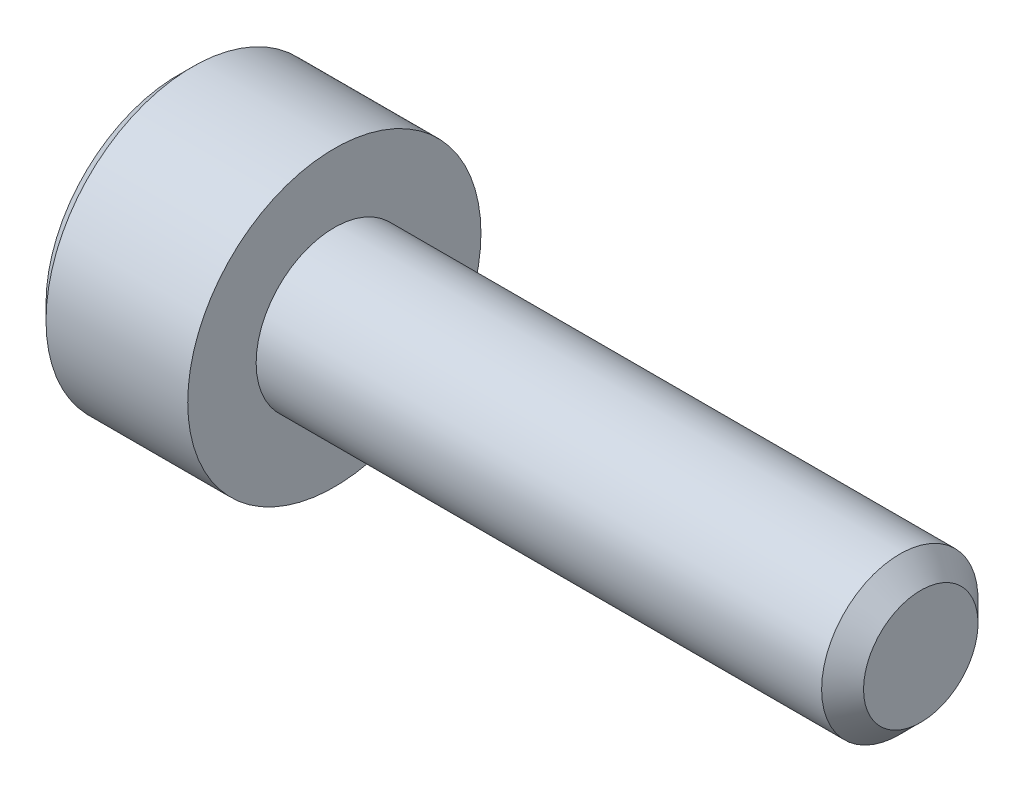
ISO-10303-21;
HEADER;
FILE_DESCRIPTION(('STEP AP214'),'2;1');
FILE_NAME('part.step','',(''),(''),'','','');
FILE_SCHEMA(('AUTOMOTIVE_DESIGN { 1 0 10303 214 1 1 1 1 }'));
ENDSEC;
DATA;
#1=APPLICATION_CONTEXT('core data for automotive mechanical design processes');
#2=APPLICATION_PROTOCOL_DEFINITION('international standard','automotive_design',2000,#1);
#3=PRODUCT_CONTEXT('',#1,'mechanical');
#4=PRODUCT('Part','Part','',(#3));
#5=PRODUCT_RELATED_PRODUCT_CATEGORY('part','',(#4));
#6=PRODUCT_DEFINITION_FORMATION('','',#4);
#7=PRODUCT_DEFINITION_CONTEXT('part definition',#1,'design');
#8=PRODUCT_DEFINITION('design','',#6,#7);
#9=PRODUCT_DEFINITION_SHAPE('','',#8);
#10=(LENGTH_UNIT() NAMED_UNIT(*) SI_UNIT(.MILLI.,.METRE.));
#11=(NAMED_UNIT(*) PLANE_ANGLE_UNIT() SI_UNIT($,.RADIAN.));
#12=(NAMED_UNIT(*) SI_UNIT($,.STERADIAN.) SOLID_ANGLE_UNIT());
#13=UNCERTAINTY_MEASURE_WITH_UNIT(LENGTH_MEASURE(1.E-05),#10,'distance_accuracy_value','');
#14=(GEOMETRIC_REPRESENTATION_CONTEXT(3) GLOBAL_UNCERTAINTY_ASSIGNED_CONTEXT((#13)) GLOBAL_UNIT_ASSIGNED_CONTEXT((#10,
#11,#12)) REPRESENTATION_CONTEXT('',''));
#15=CARTESIAN_POINT('',(0.,0.,0.));
#16=DIRECTION('',(0.,0.,1.));
#17=DIRECTION('',(1.,0.,0.));
#18=AXIS2_PLACEMENT_3D('',#15,#16,#17);
#19=CARTESIAN_POINT('',(-1.6,0.,0.));
#20=DIRECTION('',(1.,0.,0.));
#21=DIRECTION('',(0.,0.,-1.));
#22=AXIS2_PLACEMENT_3D('',#19,#20,#21);
#23=PLANE('',#22);
#24=CARTESIAN_POINT('',(-1.6,0.,0.));
#25=DIRECTION('',(-1.,0.,0.));
#26=DIRECTION('',(0.,0.,1.));
#27=AXIS2_PLACEMENT_3D('',#24,#25,#26);
#28=CIRCLE('',#27,1.35);
#29=CARTESIAN_POINT('',(-1.6,0.,1.35));
#30=VERTEX_POINT('',#29);
#31=EDGE_CURVE('E11',#30,#30,#28,.T.);
#32=ORIENTED_EDGE('',*,*,#31,.T.);
#33=EDGE_LOOP('',(#32));
#34=FACE_BOUND('',#33,.T.);
#35=DIRECTION('',(0.,-1.,0.));
#36=VECTOR('',#35,1.);
#37=CARTESIAN_POINT('',(-1.6,0.43301270189222,0.75));
#38=LINE('',#37,#36);
#39=CARTESIAN_POINT('',(-1.6,0.43301270189222,0.75));
#40=VERTEX_POINT('',#39);
#41=CARTESIAN_POINT('',(-1.6,-0.43301270189222,0.75));
#42=VERTEX_POINT('',#41);
#43=EDGE_CURVE('E52',#40,#42,#38,.T.);
#44=ORIENTED_EDGE('',*,*,#43,.T.);
#45=DIRECTION('',(0.,-0.500000000000001,-0.866025403784438));
#46=VECTOR('',#45,1.);
#47=CARTESIAN_POINT('',(-1.6,-0.43301270189222,0.75));
#48=LINE('',#47,#46);
#49=CARTESIAN_POINT('',(-1.6,-0.86602540378444,0.));
#50=VERTEX_POINT('',#49);
#51=EDGE_CURVE('E123',#42,#50,#48,.T.);
#52=ORIENTED_EDGE('',*,*,#51,.T.);
#53=DIRECTION('',(0.,0.500000000000001,-0.866025403784438));
#54=VECTOR('',#53,1.);
#55=CARTESIAN_POINT('',(-1.6,-0.86602540378444,0.));
#56=LINE('',#55,#54);
#57=CARTESIAN_POINT('',(-1.6,-0.43301270189222,-0.75));
#58=VERTEX_POINT('',#57);
#59=EDGE_CURVE('E126',#50,#58,#56,.T.);
#60=ORIENTED_EDGE('',*,*,#59,.T.);
#61=DIRECTION('',(0.,1.,0.));
#62=VECTOR('',#61,1.);
#63=CARTESIAN_POINT('',(-1.6,-0.43301270189222,-0.75));
#64=LINE('',#63,#62);
#65=CARTESIAN_POINT('',(-1.6,0.43301270189222,-0.75));
#66=VERTEX_POINT('',#65);
#67=EDGE_CURVE('E129',#58,#66,#64,.T.);
#68=ORIENTED_EDGE('',*,*,#67,.T.);
#69=DIRECTION('',(0.,0.500000000000001,0.866025403784438));
#70=VECTOR('',#69,1.);
#71=CARTESIAN_POINT('',(-1.6,0.43301270189222,-0.75));
#72=LINE('',#71,#70);
#73=CARTESIAN_POINT('',(-1.6,0.86602540378444,0.));
#74=VERTEX_POINT('',#73);
#75=EDGE_CURVE('E113',#66,#74,#72,.T.);
#76=ORIENTED_EDGE('',*,*,#75,.T.);
#77=DIRECTION('',(0.,-0.500000000000001,0.866025403784438));
#78=VECTOR('',#77,1.);
#79=CARTESIAN_POINT('',(-1.6,0.86602540378444,0.));
#80=LINE('',#79,#78);
#81=EDGE_CURVE('E132',#74,#40,#80,.T.);
#82=ORIENTED_EDGE('',*,*,#81,.T.);
#83=EDGE_LOOP('',(#44,#52,#60,#68,#76,#82));
#84=FACE_BOUND('',#83,.T.);
#85=ADVANCED_FACE('F38',(#34,#84),#23,.F.);
#86=CARTESIAN_POINT('',(-1.45,0.,0.));
#87=DIRECTION('',(1.,0.,0.));
#88=DIRECTION('',(0.,0.,-1.));
#89=AXIS2_PLACEMENT_3D('',#86,#87,#88);
#90=CONICAL_SURFACE('',#89,1.5,0.785398163397448);
#91=ORIENTED_EDGE('',*,*,#31,.F.);
#92=EDGE_LOOP('',(#91));
#93=FACE_BOUND('',#92,.T.);
#94=CARTESIAN_POINT('',(-1.45,0.,0.));
#95=DIRECTION('',(-1.,0.,0.));
#96=DIRECTION('',(0.,0.,1.));
#97=AXIS2_PLACEMENT_3D('',#94,#95,#96);
#98=CIRCLE('',#97,1.5);
#99=CARTESIAN_POINT('',(-1.45,0.,1.5));
#100=VERTEX_POINT('',#99);
#101=EDGE_CURVE('E45',#100,#100,#98,.T.);
#102=ORIENTED_EDGE('',*,*,#101,.T.);
#103=EDGE_LOOP('',(#102));
#104=FACE_BOUND('',#103,.T.);
#105=ADVANCED_FACE('F157',(#93,#104),#90,.T.);
#106=CARTESIAN_POINT('',(6.,0.,0.));
#107=DIRECTION('',(-1.,0.,0.));
#108=DIRECTION('',(0.,0.,1.));
#109=AXIS2_PLACEMENT_3D('',#106,#107,#108);
#110=CYLINDRICAL_SURFACE('',#109,1.5);
#111=ORIENTED_EDGE('',*,*,#101,.F.);
#112=EDGE_LOOP('',(#111));
#113=FACE_BOUND('',#112,.T.);
#114=CARTESIAN_POINT('',(0.,0.,0.));
#115=DIRECTION('',(-1.,0.,0.));
#116=DIRECTION('',(0.,0.,1.));
#117=AXIS2_PLACEMENT_3D('',#114,#115,#116);
#118=CIRCLE('',#117,1.5);
#119=CARTESIAN_POINT('',(0.,0.,1.5));
#120=VERTEX_POINT('',#119);
#121=EDGE_CURVE('E152',#120,#120,#118,.T.);
#122=ORIENTED_EDGE('',*,*,#121,.T.);
#123=EDGE_LOOP('',(#122));
#124=FACE_BOUND('',#123,.T.);
#125=ADVANCED_FACE('F159',(#113,#124),#110,.T.);
#126=CARTESIAN_POINT('',(0.,1.5,0.));
#127=DIRECTION('',(-1.,0.,0.));
#128=DIRECTION('',(0.,0.,1.));
#129=AXIS2_PLACEMENT_3D('',#126,#127,#128);
#130=PLANE('',#129);
#131=ORIENTED_EDGE('',*,*,#121,.F.);
#132=EDGE_LOOP('',(#131));
#133=FACE_BOUND('',#132,.T.);
#134=CARTESIAN_POINT('',(0.,0.,0.));
#135=DIRECTION('',(-1.,0.,0.));
#136=DIRECTION('',(0.,0.,1.));
#137=AXIS2_PLACEMENT_3D('',#134,#135,#136);
#138=CIRCLE('',#137,0.8);
#139=CARTESIAN_POINT('',(0.,0.,0.8));
#140=VERTEX_POINT('',#139);
#141=EDGE_CURVE('E149',#140,#140,#138,.T.);
#142=ORIENTED_EDGE('',*,*,#141,.T.);
#143=EDGE_LOOP('',(#142));
#144=FACE_BOUND('',#143,.T.);
#145=ADVANCED_FACE('F162',(#133,#144),#130,.F.);
#146=CARTESIAN_POINT('',(6.,0.,0.));
#147=DIRECTION('',(-1.,0.,0.));
#148=DIRECTION('',(0.,0.,1.));
#149=AXIS2_PLACEMENT_3D('',#146,#147,#148);
#150=CYLINDRICAL_SURFACE('',#149,0.8);
#151=ORIENTED_EDGE('',*,*,#141,.F.);
#152=EDGE_LOOP('',(#151));
#153=FACE_BOUND('',#152,.T.);
#154=CARTESIAN_POINT('',(5.7855,0.,0.));
#155=DIRECTION('',(-1.,0.,0.));
#156=DIRECTION('',(0.,0.,1.));
#157=AXIS2_PLACEMENT_3D('',#154,#155,#156);
#158=CIRCLE('',#157,0.8);
#159=CARTESIAN_POINT('',(5.7855,0.,0.8));
#160=VERTEX_POINT('',#159);
#161=EDGE_CURVE('E146',#160,#160,#158,.T.);
#162=ORIENTED_EDGE('',*,*,#161,.T.);
#163=EDGE_LOOP('',(#162));
#164=FACE_BOUND('',#163,.T.);
#165=ADVANCED_FACE('F168',(#153,#164),#150,.T.);
#166=CARTESIAN_POINT('',(6.,0.,0.));
#167=DIRECTION('',(-1.,0.,0.));
#168=DIRECTION('',(0.,0.,1.));
#169=AXIS2_PLACEMENT_3D('',#166,#167,#168);
#170=CONICAL_SURFACE('',#169,0.5855,0.785398163397448);
#171=ORIENTED_EDGE('',*,*,#161,.F.);
#172=EDGE_LOOP('',(#171));
#173=FACE_BOUND('',#172,.T.);
#174=CARTESIAN_POINT('',(6.,0.,0.));
#175=DIRECTION('',(-1.,0.,0.));
#176=DIRECTION('',(0.,0.,1.));
#177=AXIS2_PLACEMENT_3D('',#174,#175,#176);
#178=CIRCLE('',#177,0.5855);
#179=CARTESIAN_POINT('',(6.,0.,0.5855));
#180=VERTEX_POINT('',#179);
#181=EDGE_CURVE('E143',#180,#180,#178,.T.);
#182=ORIENTED_EDGE('',*,*,#181,.T.);
#183=EDGE_LOOP('',(#182));
#184=FACE_BOUND('',#183,.T.);
#185=ADVANCED_FACE('F174',(#173,#184),#170,.T.);
#186=CARTESIAN_POINT('',(6.,0.5855,0.));
#187=DIRECTION('',(-1.,0.,0.));
#188=DIRECTION('',(0.,0.,1.));
#189=AXIS2_PLACEMENT_3D('',#186,#187,#188);
#190=PLANE('',#189);
#191=ORIENTED_EDGE('',*,*,#181,.F.);
#192=EDGE_LOOP('',(#191));
#193=FACE_BOUND('',#192,.T.);
#194=ADVANCED_FACE('F180',(#193),#190,.F.);
#195=CARTESIAN_POINT('',(-0.96,0.43301270189222,0.75));
#196=DIRECTION('',(0.,0.,-1.));
#197=DIRECTION('',(-1.,0.,0.));
#198=AXIS2_PLACEMENT_3D('',#195,#196,#197);
#199=PLANE('',#198);
#200=ORIENTED_EDGE('',*,*,#43,.F.);
#201=DIRECTION('',(-1.,0.,0.));
#202=VECTOR('',#201,1.);
#203=CARTESIAN_POINT('',(-0.96,0.43301270189222,0.75));
#204=LINE('',#203,#202);
#205=CARTESIAN_POINT('',(-0.96,0.43301270189222,0.75));
#206=VERTEX_POINT('',#205);
#207=EDGE_CURVE('E118',#206,#40,#204,.T.);
#208=ORIENTED_EDGE('',*,*,#207,.F.);
#209=DIRECTION('',(0.,-1.,0.));
#210=VECTOR('',#209,1.);
#211=CARTESIAN_POINT('',(-0.96,0.43301270189222,0.75));
#212=LINE('',#211,#210);
#213=CARTESIAN_POINT('',(-0.96,-0.43301270189222,0.75));
#214=VERTEX_POINT('',#213);
#215=EDGE_CURVE('E135',#206,#214,#212,.T.);
#216=ORIENTED_EDGE('',*,*,#215,.T.);
#217=DIRECTION('',(-1.,0.,0.));
#218=VECTOR('',#217,1.);
#219=CARTESIAN_POINT('',(-0.96,-0.43301270189222,0.75));
#220=LINE('',#219,#218);
#221=EDGE_CURVE('E141',#214,#42,#220,.T.);
#222=ORIENTED_EDGE('',*,*,#221,.T.);
#223=EDGE_LOOP('',(#200,#208,#216,#222));
#224=FACE_BOUND('',#223,.T.);
#225=ADVANCED_FACE('F185',(#224),#199,.T.);
#226=CARTESIAN_POINT('',(-0.96,-0.43301270189222,0.75));
#227=DIRECTION('',(0.,0.866025403784438,-0.500000000000001));
#228=DIRECTION('',(0.,0.500000000000001,0.866025403784438));
#229=AXIS2_PLACEMENT_3D('',#226,#227,#228);
#230=PLANE('',#229);
#231=ORIENTED_EDGE('',*,*,#51,.F.);
#232=ORIENTED_EDGE('',*,*,#221,.F.);
#233=DIRECTION('',(0.,-0.500000000000001,-0.866025403784438));
#234=VECTOR('',#233,1.);
#235=CARTESIAN_POINT('',(-0.96,-0.43301270189222,0.75));
#236=LINE('',#235,#234);
#237=CARTESIAN_POINT('',(-0.96,-0.86602540378444,0.));
#238=VERTEX_POINT('',#237);
#239=EDGE_CURVE('E91',#214,#238,#236,.T.);
#240=ORIENTED_EDGE('',*,*,#239,.T.);
#241=DIRECTION('',(-1.,0.,0.));
#242=VECTOR('',#241,1.);
#243=CARTESIAN_POINT('',(-0.96,-0.86602540378444,0.));
#244=LINE('',#243,#242);
#245=EDGE_CURVE('E139',#238,#50,#244,.T.);
#246=ORIENTED_EDGE('',*,*,#245,.T.);
#247=EDGE_LOOP('',(#231,#232,#240,#246));
#248=FACE_BOUND('',#247,.T.);
#249=ADVANCED_FACE('F190',(#248),#230,.T.);
#250=CARTESIAN_POINT('',(-0.96,-0.86602540378444,0.));
#251=DIRECTION('',(0.,0.866025403784438,0.500000000000001));
#252=DIRECTION('',(0.,-0.500000000000001,0.866025403784438));
#253=AXIS2_PLACEMENT_3D('',#250,#251,#252);
#254=PLANE('',#253);
#255=ORIENTED_EDGE('',*,*,#59,.F.);
#256=ORIENTED_EDGE('',*,*,#245,.F.);
#257=DIRECTION('',(0.,0.500000000000001,-0.866025403784438));
#258=VECTOR('',#257,1.);
#259=CARTESIAN_POINT('',(-0.96,-0.86602540378444,0.));
#260=LINE('',#259,#258);
#261=CARTESIAN_POINT('',(-0.96,-0.43301270189222,-0.75));
#262=VERTEX_POINT('',#261);
#263=EDGE_CURVE('E109',#238,#262,#260,.T.);
#264=ORIENTED_EDGE('',*,*,#263,.T.);
#265=DIRECTION('',(-1.,0.,0.));
#266=VECTOR('',#265,1.);
#267=CARTESIAN_POINT('',(-0.96,-0.43301270189222,-0.75));
#268=LINE('',#267,#266);
#269=EDGE_CURVE('E106',#262,#58,#268,.T.);
#270=ORIENTED_EDGE('',*,*,#269,.T.);
#271=EDGE_LOOP('',(#255,#256,#264,#270));
#272=FACE_BOUND('',#271,.T.);
#273=ADVANCED_FACE('F207',(#272),#254,.T.);
#274=CARTESIAN_POINT('',(-0.96,-0.43301270189222,-0.75));
#275=DIRECTION('',(0.,0.,1.));
#276=DIRECTION('',(1.,0.,0.));
#277=AXIS2_PLACEMENT_3D('',#274,#275,#276);
#278=PLANE('',#277);
#279=ORIENTED_EDGE('',*,*,#67,.F.);
#280=ORIENTED_EDGE('',*,*,#269,.F.);
#281=DIRECTION('',(0.,1.,0.));
#282=VECTOR('',#281,1.);
#283=CARTESIAN_POINT('',(-0.96,-0.43301270189222,-0.75));
#284=LINE('',#283,#282);
#285=CARTESIAN_POINT('',(-0.96,0.43301270189222,-0.75));
#286=VERTEX_POINT('',#285);
#287=EDGE_CURVE('E101',#262,#286,#284,.T.);
#288=ORIENTED_EDGE('',*,*,#287,.T.);
#289=DIRECTION('',(-1.,0.,0.));
#290=VECTOR('',#289,1.);
#291=CARTESIAN_POINT('',(-0.96,0.43301270189222,-0.75));
#292=LINE('',#291,#290);
#293=EDGE_CURVE('E105',#286,#66,#292,.T.);
#294=ORIENTED_EDGE('',*,*,#293,.T.);
#295=EDGE_LOOP('',(#279,#280,#288,#294));
#296=FACE_BOUND('',#295,.T.);
#297=ADVANCED_FACE('F104',(#296),#278,.T.);
#298=CARTESIAN_POINT('',(-0.96,0.43301270189222,-0.75));
#299=DIRECTION('',(0.,-0.866025403784438,0.500000000000001));
#300=DIRECTION('',(0.,-0.500000000000001,-0.866025403784438));
#301=AXIS2_PLACEMENT_3D('',#298,#299,#300);
#302=PLANE('',#301);
#303=ORIENTED_EDGE('',*,*,#75,.F.);
#304=ORIENTED_EDGE('',*,*,#293,.F.);
#305=DIRECTION('',(0.,0.500000000000001,0.866025403784438));
#306=VECTOR('',#305,1.);
#307=CARTESIAN_POINT('',(-0.96,0.43301270189222,-0.75));
#308=LINE('',#307,#306);
#309=CARTESIAN_POINT('',(-0.96,0.86602540378444,0.));
#310=VERTEX_POINT('',#309);
#311=EDGE_CURVE('E108',#286,#310,#308,.T.);
#312=ORIENTED_EDGE('',*,*,#311,.T.);
#313=DIRECTION('',(-1.,0.,0.));
#314=VECTOR('',#313,1.);
#315=CARTESIAN_POINT('',(-0.96,0.86602540378444,0.));
#316=LINE('',#315,#314);
#317=EDGE_CURVE('E82',#310,#74,#316,.T.);
#318=ORIENTED_EDGE('',*,*,#317,.T.);
#319=EDGE_LOOP('',(#303,#304,#312,#318));
#320=FACE_BOUND('',#319,.T.);
#321=ADVANCED_FACE('F111',(#320),#302,.T.);
#322=CARTESIAN_POINT('',(-0.96,0.86602540378444,0.));
#323=DIRECTION('',(0.,-0.866025403784438,-0.500000000000001));
#324=DIRECTION('',(0.,0.500000000000001,-0.866025403784438));
#325=AXIS2_PLACEMENT_3D('',#322,#323,#324);
#326=PLANE('',#325);
#327=ORIENTED_EDGE('',*,*,#81,.F.);
#328=ORIENTED_EDGE('',*,*,#317,.F.);
#329=DIRECTION('',(0.,-0.500000000000001,0.866025403784438));
#330=VECTOR('',#329,1.);
#331=CARTESIAN_POINT('',(-0.96,0.86602540378444,0.));
#332=LINE('',#331,#330);
#333=EDGE_CURVE('E60',#310,#206,#332,.T.);
#334=ORIENTED_EDGE('',*,*,#333,.T.);
#335=ORIENTED_EDGE('',*,*,#207,.T.);
#336=EDGE_LOOP('',(#327,#328,#334,#335));
#337=FACE_BOUND('',#336,.T.);
#338=ADVANCED_FACE('F200',(#337),#326,.T.);
#339=CARTESIAN_POINT('',(-0.96,0.,0.));
#340=DIRECTION('',(1.,0.,0.));
#341=DIRECTION('',(0.,0.,-1.));
#342=AXIS2_PLACEMENT_3D('',#339,#340,#341);
#343=PLANE('',#342);
#344=ORIENTED_EDGE('',*,*,#215,.F.);
#345=ORIENTED_EDGE('',*,*,#333,.F.);
#346=ORIENTED_EDGE('',*,*,#311,.F.);
#347=ORIENTED_EDGE('',*,*,#287,.F.);
#348=ORIENTED_EDGE('',*,*,#263,.F.);
#349=ORIENTED_EDGE('',*,*,#239,.F.);
#350=EDGE_LOOP('',(#344,#345,#346,#347,#348,#349));
#351=FACE_BOUND('',#350,.T.);
#352=ADVANCED_FACE('F116',(#351),#343,.F.);
#353=CLOSED_SHELL('',(#85,#105,#125,#145,#165,#185,#194,#225,#249,#273,#297,#321,#338,#352));
#354=MANIFOLD_SOLID_BREP('B2',#353);
#355=ADVANCED_BREP_SHAPE_REPRESENTATION('',(#18,#354),#14);
#356=SHAPE_DEFINITION_REPRESENTATION(#9,#355);
ENDSEC;
END-ISO-10303-21;
